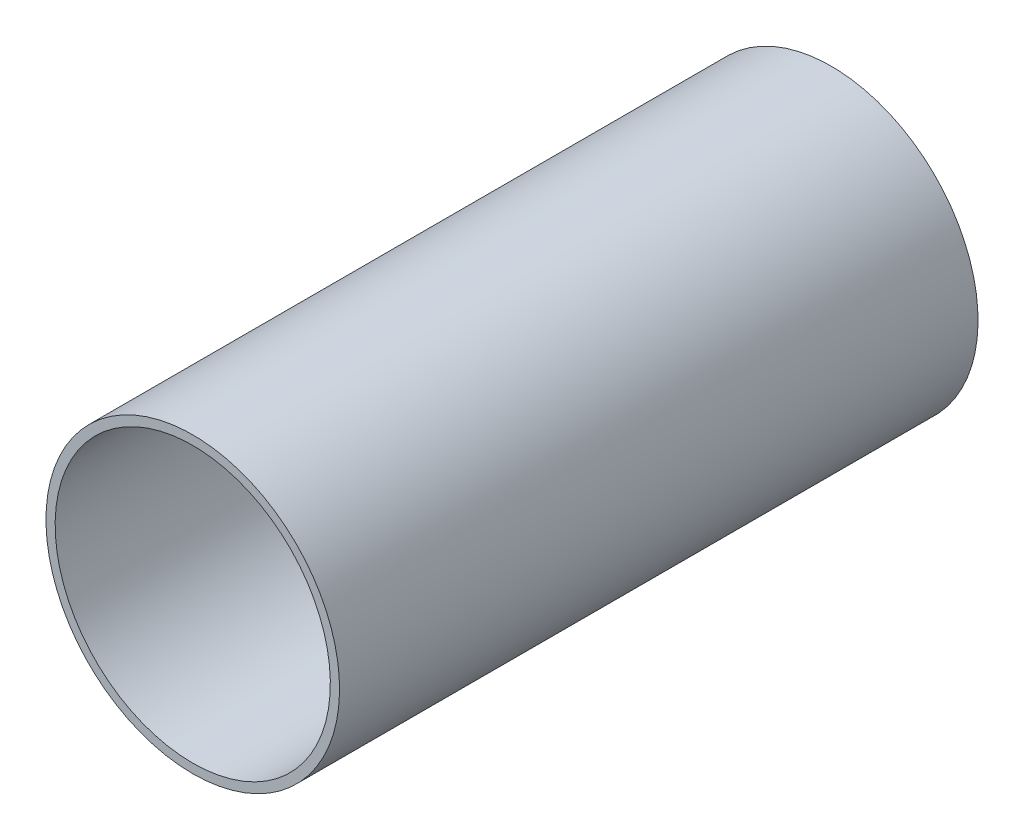
ISO-10303-21;
HEADER;
FILE_DESCRIPTION(('STEP AP214'),'2;1');
FILE_NAME('part.step','',(''),(''),'','','');
FILE_SCHEMA(('AUTOMOTIVE_DESIGN { 1 0 10303 214 1 1 1 1 }'));
ENDSEC;
DATA;
#1=APPLICATION_CONTEXT('core data for automotive mechanical design processes');
#2=APPLICATION_PROTOCOL_DEFINITION('international standard','automotive_design',2000,#1);
#3=PRODUCT_CONTEXT('',#1,'mechanical');
#4=PRODUCT('Part','Part','',(#3));
#5=PRODUCT_RELATED_PRODUCT_CATEGORY('part','',(#4));
#6=PRODUCT_DEFINITION_FORMATION('','',#4);
#7=PRODUCT_DEFINITION_CONTEXT('part definition',#1,'design');
#8=PRODUCT_DEFINITION('design','',#6,#7);
#9=PRODUCT_DEFINITION_SHAPE('','',#8);
#10=(LENGTH_UNIT() NAMED_UNIT(*) SI_UNIT(.MILLI.,.METRE.));
#11=(NAMED_UNIT(*) PLANE_ANGLE_UNIT() SI_UNIT($,.RADIAN.));
#12=(NAMED_UNIT(*) SI_UNIT($,.STERADIAN.) SOLID_ANGLE_UNIT());
#13=UNCERTAINTY_MEASURE_WITH_UNIT(LENGTH_MEASURE(1.E-05),#10,'distance_accuracy_value','');
#14=(GEOMETRIC_REPRESENTATION_CONTEXT(3) GLOBAL_UNCERTAINTY_ASSIGNED_CONTEXT((#13)) GLOBAL_UNIT_ASSIGNED_CONTEXT((#10,
#11,#12)) REPRESENTATION_CONTEXT('',''));
#15=CARTESIAN_POINT('',(0.,0.,0.));
#16=DIRECTION('',(0.,0.,1.));
#17=DIRECTION('',(1.,0.,0.));
#18=AXIS2_PLACEMENT_3D('',#15,#16,#17);
#19=CARTESIAN_POINT('',(142.24,-103.632,-0.045));
#20=DIRECTION('',(0.,0.,-1.));
#21=DIRECTION('',(0.,-1.,0.));
#22=AXIS2_PLACEMENT_3D('',#19,#20,#21);
#23=CYLINDRICAL_SURFACE('',#22,0.375);
#24=CARTESIAN_POINT('',(142.24,-103.632,-0.035));
#25=DIRECTION('',(0.,0.,-1.));
#26=DIRECTION('',(0.,-1.,0.));
#27=AXIS2_PLACEMENT_3D('',#24,#25,#26);
#28=CIRCLE('',#27,0.375);
#29=CARTESIAN_POINT('',(142.24,-104.007,-0.035));
#30=VERTEX_POINT('',#29);
#31=EDGE_CURVE('E65',#30,#30,#28,.T.);
#32=ORIENTED_EDGE('',*,*,#31,.T.);
#33=DIRECTION('',(0.,0.,1.));
#34=VECTOR('',#33,1.);
#35=CARTESIAN_POINT('',(142.24,-104.007,-0.045));
#36=LINE('',#35,#34);
#37=CARTESIAN_POINT('',(142.24,-104.007,1.705));
#38=VERTEX_POINT('',#37);
#39=EDGE_CURVE('E11',#30,#38,#36,.T.);
#40=ORIENTED_EDGE('',*,*,#39,.T.);
#41=CARTESIAN_POINT('',(142.24,-103.632,1.705));
#42=DIRECTION('',(0.,0.,-1.));
#43=DIRECTION('',(0.,-1.,0.));
#44=AXIS2_PLACEMENT_3D('',#41,#42,#43);
#45=CIRCLE('',#44,0.375);
#46=EDGE_CURVE('E26',#38,#38,#45,.T.);
#47=ORIENTED_EDGE('',*,*,#46,.F.);
#48=ORIENTED_EDGE('',*,*,#39,.F.);
#49=EDGE_LOOP('',(#32,#40,#47,#48));
#50=FACE_BOUND('',#49,.T.);
#51=ADVANCED_FACE('F17',(#50),#23,.F.);
#52=CARTESIAN_POINT('',(142.24,-104.032,1.705));
#53=DIRECTION('',(0.,0.,1.));
#54=DIRECTION('',(1.,0.,0.));
#55=AXIS2_PLACEMENT_3D('',#52,#53,#54);
#56=PLANE('',#55);
#57=ORIENTED_EDGE('',*,*,#46,.T.);
#58=EDGE_LOOP('',(#57));
#59=FACE_BOUND('',#58,.T.);
#60=CARTESIAN_POINT('',(142.24,-103.632,1.705));
#61=DIRECTION('',(0.,0.,1.));
#62=DIRECTION('',(0.,-1.,0.));
#63=AXIS2_PLACEMENT_3D('',#60,#61,#62);
#64=CIRCLE('',#63,0.4);
#65=CARTESIAN_POINT('',(142.24,-104.032,1.705));
#66=VERTEX_POINT('',#65);
#67=EDGE_CURVE('E57',#66,#66,#64,.T.);
#68=ORIENTED_EDGE('',*,*,#67,.T.);
#69=EDGE_LOOP('',(#68));
#70=FACE_BOUND('',#69,.T.);
#71=ADVANCED_FACE('F19',(#59,#70),#56,.T.);
#72=CARTESIAN_POINT('',(142.24,-104.032,-0.035));
#73=DIRECTION('',(0.,0.,1.));
#74=DIRECTION('',(1.,0.,0.));
#75=AXIS2_PLACEMENT_3D('',#72,#73,#74);
#76=PLANE('',#75);
#77=ORIENTED_EDGE('',*,*,#31,.F.);
#78=EDGE_LOOP('',(#77));
#79=FACE_BOUND('',#78,.T.);
#80=CARTESIAN_POINT('',(142.24,-103.632,-0.035));
#81=DIRECTION('',(0.,0.,1.));
#82=DIRECTION('',(0.,-1.,0.));
#83=AXIS2_PLACEMENT_3D('',#80,#81,#82);
#84=CIRCLE('',#83,0.4);
#85=CARTESIAN_POINT('',(142.24,-104.032,-0.035));
#86=VERTEX_POINT('',#85);
#87=EDGE_CURVE('E56',#86,#86,#84,.T.);
#88=ORIENTED_EDGE('',*,*,#87,.F.);
#89=EDGE_LOOP('',(#88));
#90=FACE_BOUND('',#89,.T.);
#91=ADVANCED_FACE('F82',(#79,#90),#76,.F.);
#92=CARTESIAN_POINT('',(142.24,-103.632,-0.035));
#93=DIRECTION('',(0.,0.,-1.));
#94=DIRECTION('',(0.,-1.,0.));
#95=AXIS2_PLACEMENT_3D('',#92,#93,#94);
#96=CYLINDRICAL_SURFACE('',#95,0.4);
#97=ORIENTED_EDGE('',*,*,#87,.T.);
#98=DIRECTION('',(0.,0.,1.));
#99=VECTOR('',#98,1.);
#100=CARTESIAN_POINT('',(142.24,-104.032,-0.035));
#101=LINE('',#100,#99);
#102=EDGE_CURVE('E53',#86,#66,#101,.T.);
#103=ORIENTED_EDGE('',*,*,#102,.T.);
#104=ORIENTED_EDGE('',*,*,#67,.F.);
#105=ORIENTED_EDGE('',*,*,#102,.F.);
#106=EDGE_LOOP('',(#97,#103,#104,#105));
#107=FACE_BOUND('',#106,.T.);
#108=ADVANCED_FACE('F54',(#107),#96,.T.);
#109=CLOSED_SHELL('',(#51,#71,#91,#108));
#110=MANIFOLD_SOLID_BREP('B1',#109);
#111=ADVANCED_BREP_SHAPE_REPRESENTATION('',(#18,#110),#14);
#112=SHAPE_DEFINITION_REPRESENTATION(#9,#111);
ENDSEC;
END-ISO-10303-21;
